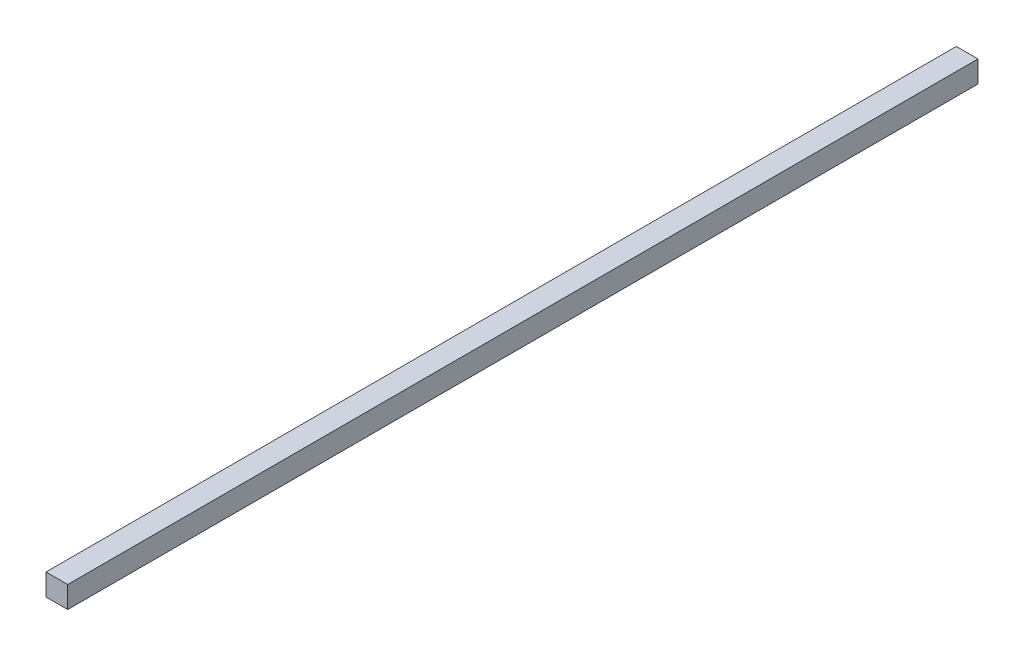
ISO-10303-21;
HEADER;
FILE_DESCRIPTION(('STEP AP214'),'2;1');
FILE_NAME('part.step','',(''),(''),'','','');
FILE_SCHEMA(('AUTOMOTIVE_DESIGN { 1 0 10303 214 1 1 1 1 }'));
ENDSEC;
DATA;
#1=APPLICATION_CONTEXT('core data for automotive mechanical design processes');
#2=APPLICATION_PROTOCOL_DEFINITION('international standard','automotive_design',2000,#1);
#3=PRODUCT_CONTEXT('',#1,'mechanical');
#4=PRODUCT('Part','Part','',(#3));
#5=PRODUCT_RELATED_PRODUCT_CATEGORY('part','',(#4));
#6=PRODUCT_DEFINITION_FORMATION('','',#4);
#7=PRODUCT_DEFINITION_CONTEXT('part definition',#1,'design');
#8=PRODUCT_DEFINITION('design','',#6,#7);
#9=PRODUCT_DEFINITION_SHAPE('','',#8);
#10=(LENGTH_UNIT() NAMED_UNIT(*) SI_UNIT(.MILLI.,.METRE.));
#11=(NAMED_UNIT(*) PLANE_ANGLE_UNIT() SI_UNIT($,.RADIAN.));
#12=(NAMED_UNIT(*) SI_UNIT($,.STERADIAN.) SOLID_ANGLE_UNIT());
#13=UNCERTAINTY_MEASURE_WITH_UNIT(LENGTH_MEASURE(1.E-05),#10,'distance_accuracy_value','');
#14=(GEOMETRIC_REPRESENTATION_CONTEXT(3) GLOBAL_UNCERTAINTY_ASSIGNED_CONTEXT((#13)) GLOBAL_UNIT_ASSIGNED_CONTEXT((#10,
#11,#12)) REPRESENTATION_CONTEXT('',''));
#15=CARTESIAN_POINT('',(0.,0.,0.));
#16=DIRECTION('',(0.,0.,1.));
#17=DIRECTION('',(1.,0.,0.));
#18=AXIS2_PLACEMENT_3D('',#15,#16,#17);
#19=CARTESIAN_POINT('',(0.,25.4000000000001,0.));
#20=DIRECTION('',(1.,0.,0.));
#21=DIRECTION('',(0.,0.,-1.));
#22=AXIS2_PLACEMENT_3D('',#19,#20,#21);
#23=PLANE('',#22);
#24=DIRECTION('',(0.,0.,1.));
#25=VECTOR('',#24,1.);
#26=CARTESIAN_POINT('',(0.,0.,0.));
#27=LINE('',#26,#25);
#28=CARTESIAN_POINT('',(4.44089209850063E-13,0.,-1066.49757618103));
#29=VERTEX_POINT('',#28);
#30=CARTESIAN_POINT('',(0.,0.,0.));
#31=VERTEX_POINT('',#30);
#32=EDGE_CURVE('E97',#29,#31,#27,.T.);
#33=ORIENTED_EDGE('',*,*,#32,.T.);
#34=DIRECTION('',(0.,-1.,0.));
#35=VECTOR('',#34,1.);
#36=CARTESIAN_POINT('',(0.,25.4000000000001,0.));
#37=LINE('',#36,#35);
#38=CARTESIAN_POINT('',(0.,25.4000000000001,0.));
#39=VERTEX_POINT('',#38);
#40=EDGE_CURVE('E11',#39,#31,#37,.T.);
#41=ORIENTED_EDGE('',*,*,#40,.F.);
#42=DIRECTION('',(0.,0.,1.));
#43=VECTOR('',#42,1.);
#44=CARTESIAN_POINT('',(0.,25.4000000000001,0.));
#45=LINE('',#44,#43);
#46=CARTESIAN_POINT('',(4.44089209850063E-13,25.4000000000001,-1066.49757618103));
#47=VERTEX_POINT('',#46);
#48=EDGE_CURVE('E85',#47,#39,#45,.T.);
#49=ORIENTED_EDGE('',*,*,#48,.F.);
#50=DIRECTION('',(0.,-1.,0.));
#51=VECTOR('',#50,1.);
#52=CARTESIAN_POINT('',(4.44089209850063E-13,25.4000000000001,-1066.49757618103));
#53=LINE('',#52,#51);
#54=EDGE_CURVE('E93',#47,#29,#53,.T.);
#55=ORIENTED_EDGE('',*,*,#54,.T.);
#56=EDGE_LOOP('',(#33,#41,#49,#55));
#57=FACE_BOUND('',#56,.T.);
#58=ADVANCED_FACE('F34',(#57),#23,.F.);
#59=CARTESIAN_POINT('',(0.,25.4000000000001,0.));
#60=DIRECTION('',(0.,0.,-1.));
#61=DIRECTION('',(-1.,0.,0.));
#62=AXIS2_PLACEMENT_3D('',#59,#60,#61);
#63=PLANE('',#62);
#64=DIRECTION('',(1.,0.,0.));
#65=VECTOR('',#64,1.);
#66=CARTESIAN_POINT('',(0.,0.,0.));
#67=LINE('',#66,#65);
#68=CARTESIAN_POINT('',(25.4000000000008,0.,-1.33226762955019E-12));
#69=VERTEX_POINT('',#68);
#70=EDGE_CURVE('E89',#31,#69,#67,.T.);
#71=ORIENTED_EDGE('',*,*,#70,.T.);
#72=DIRECTION('',(0.,-1.,0.));
#73=VECTOR('',#72,1.);
#74=CARTESIAN_POINT('',(25.4000000000008,25.4000000000001,-1.33226762955019E-12));
#75=LINE('',#74,#73);
#76=CARTESIAN_POINT('',(25.4000000000008,25.4000000000001,-1.33226762955019E-12));
#77=VERTEX_POINT('',#76);
#78=EDGE_CURVE('E42',#77,#69,#75,.T.);
#79=ORIENTED_EDGE('',*,*,#78,.F.);
#80=DIRECTION('',(1.,0.,0.));
#81=VECTOR('',#80,1.);
#82=CARTESIAN_POINT('',(0.,25.4000000000001,0.));
#83=LINE('',#82,#81);
#84=EDGE_CURVE('E80',#39,#77,#83,.T.);
#85=ORIENTED_EDGE('',*,*,#84,.F.);
#86=ORIENTED_EDGE('',*,*,#40,.T.);
#87=EDGE_LOOP('',(#71,#79,#85,#86));
#88=FACE_BOUND('',#87,.T.);
#89=ADVANCED_FACE('F88',(#88),#63,.F.);
#90=CARTESIAN_POINT('',(25.4000000000008,25.4000000000001,-1.33226762955019E-12));
#91=DIRECTION('',(-1.,0.,0.));
#92=DIRECTION('',(0.,0.,1.));
#93=AXIS2_PLACEMENT_3D('',#90,#91,#92);
#94=PLANE('',#93);
#95=DIRECTION('',(0.,0.,-1.));
#96=VECTOR('',#95,1.);
#97=CARTESIAN_POINT('',(25.4000000000008,0.,-1.33226762955019E-12));
#98=LINE('',#97,#96);
#99=CARTESIAN_POINT('',(25.4000000000012,0.,-1066.49757618103));
#100=VERTEX_POINT('',#99);
#101=EDGE_CURVE('E67',#69,#100,#98,.T.);
#102=ORIENTED_EDGE('',*,*,#101,.T.);
#103=DIRECTION('',(0.,-1.,0.));
#104=VECTOR('',#103,1.);
#105=CARTESIAN_POINT('',(25.4000000000012,25.4000000000001,-1066.49757618103));
#106=LINE('',#105,#104);
#107=CARTESIAN_POINT('',(25.4000000000012,25.4000000000001,-1066.49757618103));
#108=VERTEX_POINT('',#107);
#109=EDGE_CURVE('E90',#108,#100,#106,.T.);
#110=ORIENTED_EDGE('',*,*,#109,.F.);
#111=DIRECTION('',(0.,0.,-1.));
#112=VECTOR('',#111,1.);
#113=CARTESIAN_POINT('',(25.4000000000008,25.4000000000001,-1.33226762955019E-12));
#114=LINE('',#113,#112);
#115=EDGE_CURVE('E83',#77,#108,#114,.T.);
#116=ORIENTED_EDGE('',*,*,#115,.F.);
#117=ORIENTED_EDGE('',*,*,#78,.T.);
#118=EDGE_LOOP('',(#102,#110,#116,#117));
#119=FACE_BOUND('',#118,.T.);
#120=ADVANCED_FACE('F91',(#119),#94,.F.);
#121=CARTESIAN_POINT('',(4.44089209850063E-13,25.4000000000001,-1066.49757618103));
#122=DIRECTION('',(0.,0.,1.));
#123=DIRECTION('',(1.,0.,0.));
#124=AXIS2_PLACEMENT_3D('',#121,#122,#123);
#125=PLANE('',#124);
#126=DIRECTION('',(-1.,0.,0.));
#127=VECTOR('',#126,1.);
#128=CARTESIAN_POINT('',(4.44089209850063E-13,0.,-1066.49757618103));
#129=LINE('',#128,#127);
#130=EDGE_CURVE('E73',#100,#29,#129,.T.);
#131=ORIENTED_EDGE('',*,*,#130,.T.);
#132=ORIENTED_EDGE('',*,*,#54,.F.);
#133=DIRECTION('',(-1.,0.,0.));
#134=VECTOR('',#133,1.);
#135=CARTESIAN_POINT('',(4.44089209850063E-13,25.4000000000001,-1066.49757618103));
#136=LINE('',#135,#134);
#137=EDGE_CURVE('E50',#108,#47,#136,.T.);
#138=ORIENTED_EDGE('',*,*,#137,.F.);
#139=ORIENTED_EDGE('',*,*,#109,.T.);
#140=EDGE_LOOP('',(#131,#132,#138,#139));
#141=FACE_BOUND('',#140,.T.);
#142=ADVANCED_FACE('F104',(#141),#125,.F.);
#143=CARTESIAN_POINT('',(0.,25.4000000000001,0.));
#144=DIRECTION('',(0.,-1.,0.));
#145=DIRECTION('',(0.,0.,-1.));
#146=AXIS2_PLACEMENT_3D('',#143,#144,#145);
#147=PLANE('',#146);
#148=ORIENTED_EDGE('',*,*,#48,.T.);
#149=ORIENTED_EDGE('',*,*,#84,.T.);
#150=ORIENTED_EDGE('',*,*,#115,.T.);
#151=ORIENTED_EDGE('',*,*,#137,.T.);
#152=EDGE_LOOP('',(#148,#149,#150,#151));
#153=FACE_BOUND('',#152,.T.);
#154=ADVANCED_FACE('F81',(#153),#147,.F.);
#155=CARTESIAN_POINT('',(0.,0.,0.));
#156=DIRECTION('',(0.,-1.,0.));
#157=DIRECTION('',(0.,0.,-1.));
#158=AXIS2_PLACEMENT_3D('',#155,#156,#157);
#159=PLANE('',#158);
#160=ORIENTED_EDGE('',*,*,#32,.F.);
#161=ORIENTED_EDGE('',*,*,#130,.F.);
#162=ORIENTED_EDGE('',*,*,#101,.F.);
#163=ORIENTED_EDGE('',*,*,#70,.F.);
#164=EDGE_LOOP('',(#160,#161,#162,#163));
#165=FACE_BOUND('',#164,.T.);
#166=ADVANCED_FACE('F107',(#165),#159,.T.);
#167=CLOSED_SHELL('',(#58,#89,#120,#142,#154,#166));
#168=MANIFOLD_SOLID_BREP('B2',#167);
#169=ADVANCED_BREP_SHAPE_REPRESENTATION('',(#18,#168),#14);
#170=SHAPE_DEFINITION_REPRESENTATION(#9,#169);
ENDSEC;
END-ISO-10303-21;
